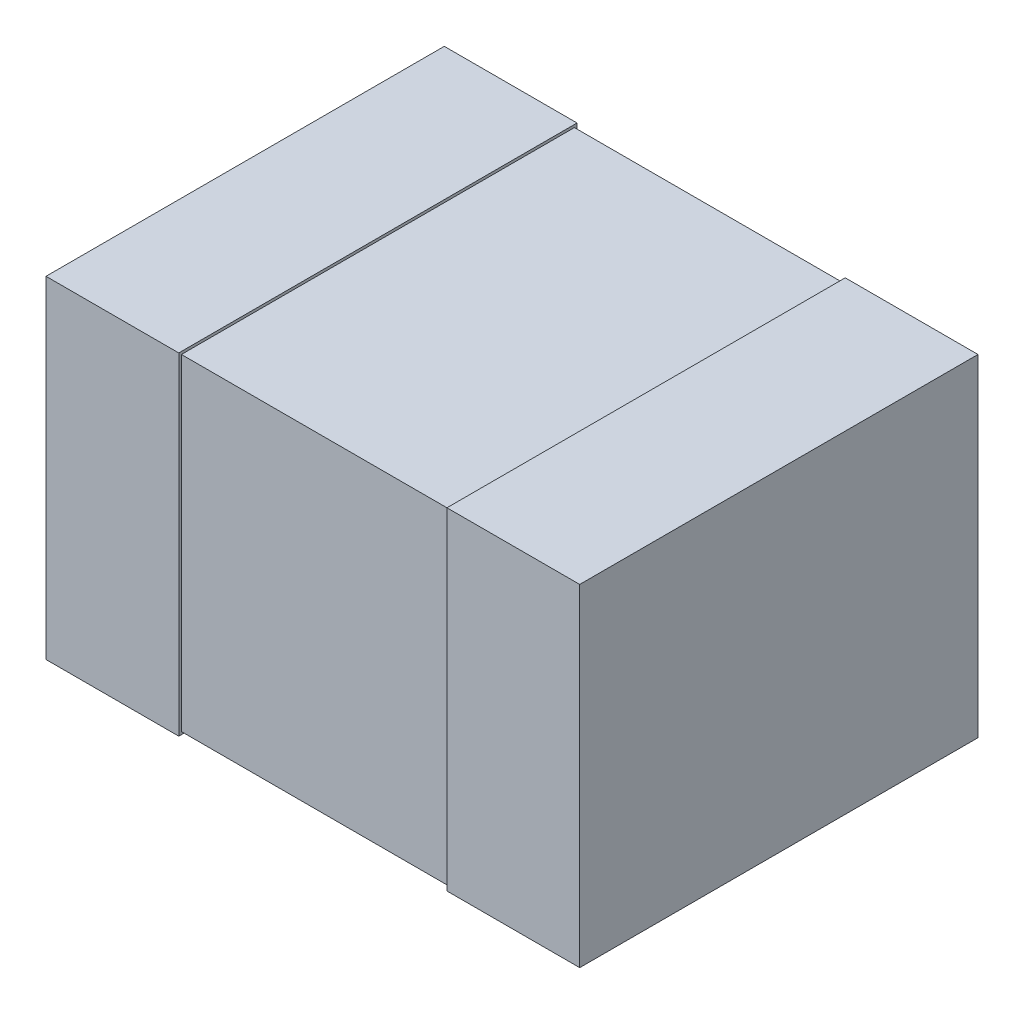
ISO-10303-21;
HEADER;
FILE_DESCRIPTION(('STEP AP214'),'2;1');
FILE_NAME('part.step','',(''),(''),'','','');
FILE_SCHEMA(('AUTOMOTIVE_DESIGN { 1 0 10303 214 1 1 1 1 }'));
ENDSEC;
DATA;
#1=APPLICATION_CONTEXT('core data for automotive mechanical design processes');
#2=APPLICATION_PROTOCOL_DEFINITION('international standard','automotive_design',2000,#1);
#3=PRODUCT_CONTEXT('',#1,'mechanical');
#4=PRODUCT('Part','Part','',(#3));
#5=PRODUCT_RELATED_PRODUCT_CATEGORY('part','',(#4));
#6=PRODUCT_DEFINITION_FORMATION('','',#4);
#7=PRODUCT_DEFINITION_CONTEXT('part definition',#1,'design');
#8=PRODUCT_DEFINITION('design','',#6,#7);
#9=PRODUCT_DEFINITION_SHAPE('','',#8);
#10=(LENGTH_UNIT() NAMED_UNIT(*) SI_UNIT(.MILLI.,.METRE.));
#11=(NAMED_UNIT(*) PLANE_ANGLE_UNIT() SI_UNIT($,.RADIAN.));
#12=(NAMED_UNIT(*) SI_UNIT($,.STERADIAN.) SOLID_ANGLE_UNIT());
#13=UNCERTAINTY_MEASURE_WITH_UNIT(LENGTH_MEASURE(1.E-05),#10,'distance_accuracy_value','');
#14=(GEOMETRIC_REPRESENTATION_CONTEXT(3) GLOBAL_UNCERTAINTY_ASSIGNED_CONTEXT((#13)) GLOBAL_UNIT_ASSIGNED_CONTEXT((#10,
#11,#12)) REPRESENTATION_CONTEXT('',''));
#15=CARTESIAN_POINT('',(0.,0.,0.));
#16=DIRECTION('',(0.,0.,1.));
#17=DIRECTION('',(1.,0.,0.));
#18=AXIS2_PLACEMENT_3D('',#15,#16,#17);
#19=CARTESIAN_POINT('',(1.005,-0.625,0.0762));
#20=DIRECTION('',(1.,0.,0.));
#21=DIRECTION('',(0.,1.,0.));
#22=AXIS2_PLACEMENT_3D('',#19,#20,#21);
#23=PLANE('',#22);
#24=DIRECTION('',(0.,1.,0.));
#25=VECTOR('',#24,1.);
#26=CARTESIAN_POINT('',(1.005,-0.625,0.0762));
#27=LINE('',#26,#25);
#28=CARTESIAN_POINT('',(1.005,-0.625,0.0762));
#29=VERTEX_POINT('',#28);
#30=CARTESIAN_POINT('',(1.005,0.625,0.0762));
#31=VERTEX_POINT('',#30);
#32=EDGE_CURVE('E207',#29,#31,#27,.T.);
#33=ORIENTED_EDGE('',*,*,#32,.T.);
#34=DIRECTION('',(0.,0.,1.));
#35=VECTOR('',#34,1.);
#36=CARTESIAN_POINT('',(1.005,0.625,0.0762));
#37=LINE('',#36,#35);
#38=CARTESIAN_POINT('',(1.005,0.625,1.5762));
#39=VERTEX_POINT('',#38);
#40=EDGE_CURVE('E145',#31,#39,#37,.T.);
#41=ORIENTED_EDGE('',*,*,#40,.T.);
#42=DIRECTION('',(0.,1.,0.));
#43=VECTOR('',#42,1.);
#44=CARTESIAN_POINT('',(1.005,-0.625,1.5762));
#45=LINE('',#44,#43);
#46=CARTESIAN_POINT('',(1.005,-0.625,1.5762));
#47=VERTEX_POINT('',#46);
#48=EDGE_CURVE('E141',#47,#39,#45,.T.);
#49=ORIENTED_EDGE('',*,*,#48,.F.);
#50=DIRECTION('',(0.,0.,1.));
#51=VECTOR('',#50,1.);
#52=CARTESIAN_POINT('',(1.005,-0.625,0.0762));
#53=LINE('',#52,#51);
#54=EDGE_CURVE('E11',#29,#47,#53,.T.);
#55=ORIENTED_EDGE('',*,*,#54,.F.);
#56=EDGE_LOOP('',(#33,#41,#49,#55));
#57=FACE_BOUND('',#56,.T.);
#58=ADVANCED_FACE('F17',(#57),#23,.T.);
#59=CARTESIAN_POINT('',(-1.005,0.625,0.0762));
#60=DIRECTION('',(-1.,0.,0.));
#61=DIRECTION('',(0.,0.,1.));
#62=AXIS2_PLACEMENT_3D('',#59,#60,#61);
#63=PLANE('',#62);
#64=DIRECTION('',(0.,-1.,0.));
#65=VECTOR('',#64,1.);
#66=CARTESIAN_POINT('',(-1.005,0.625,0.0762));
#67=LINE('',#66,#65);
#68=CARTESIAN_POINT('',(-1.005,0.625,0.0762));
#69=VERTEX_POINT('',#68);
#70=CARTESIAN_POINT('',(-1.005,-0.625,0.0762));
#71=VERTEX_POINT('',#70);
#72=EDGE_CURVE('E196',#69,#71,#67,.T.);
#73=ORIENTED_EDGE('',*,*,#72,.T.);
#74=DIRECTION('',(0.,0.,1.));
#75=VECTOR('',#74,1.);
#76=CARTESIAN_POINT('',(-1.005,-0.625,0.0762));
#77=LINE('',#76,#75);
#78=CARTESIAN_POINT('',(-1.005,-0.625,1.5762));
#79=VERTEX_POINT('',#78);
#80=EDGE_CURVE('E28',#71,#79,#77,.T.);
#81=ORIENTED_EDGE('',*,*,#80,.T.);
#82=DIRECTION('',(0.,-1.,0.));
#83=VECTOR('',#82,1.);
#84=CARTESIAN_POINT('',(-1.005,0.625,1.5762));
#85=LINE('',#84,#83);
#86=CARTESIAN_POINT('',(-1.005,0.625,1.5762));
#87=VERTEX_POINT('',#86);
#88=EDGE_CURVE('E215',#87,#79,#85,.T.);
#89=ORIENTED_EDGE('',*,*,#88,.F.);
#90=DIRECTION('',(0.,0.,1.));
#91=VECTOR('',#90,1.);
#92=CARTESIAN_POINT('',(-1.005,0.625,0.0762));
#93=LINE('',#92,#91);
#94=EDGE_CURVE('E157',#69,#87,#93,.T.);
#95=ORIENTED_EDGE('',*,*,#94,.F.);
#96=EDGE_LOOP('',(#73,#81,#89,#95));
#97=FACE_BOUND('',#96,.T.);
#98=ADVANCED_FACE('F309',(#97),#63,.T.);
#99=CARTESIAN_POINT('',(-1.005,-0.625,0.0762));
#100=DIRECTION('',(0.,-1.,0.));
#101=DIRECTION('',(0.,0.,-1.));
#102=AXIS2_PLACEMENT_3D('',#99,#100,#101);
#103=PLANE('',#102);
#104=DIRECTION('',(0.,0.,1.));
#105=VECTOR('',#104,1.);
#106=CARTESIAN_POINT('',(0.505,-0.625,0.0762));
#107=LINE('',#106,#105);
#108=CARTESIAN_POINT('',(0.505,-0.625,0.0762));
#109=VERTEX_POINT('',#108);
#110=CARTESIAN_POINT('',(0.505,-0.625,1.5762));
#111=VERTEX_POINT('',#110);
#112=EDGE_CURVE('E21',#109,#111,#107,.T.);
#113=ORIENTED_EDGE('',*,*,#112,.F.);
#114=DIRECTION('',(1.,0.,0.));
#115=VECTOR('',#114,1.);
#116=CARTESIAN_POINT('',(0.505,-0.625,0.0762));
#117=LINE('',#116,#115);
#118=EDGE_CURVE('E203',#109,#29,#117,.T.);
#119=ORIENTED_EDGE('',*,*,#118,.T.);
#120=ORIENTED_EDGE('',*,*,#54,.T.);
#121=DIRECTION('',(1.,0.,0.));
#122=VECTOR('',#121,1.);
#123=CARTESIAN_POINT('',(0.505,-0.625,1.5762));
#124=LINE('',#123,#122);
#125=EDGE_CURVE('E202',#111,#47,#124,.T.);
#126=ORIENTED_EDGE('',*,*,#125,.F.);
#127=EDGE_LOOP('',(#113,#119,#120,#126));
#128=FACE_BOUND('',#127,.T.);
#129=ADVANCED_FACE('F311',(#128),#103,.T.);
#130=CARTESIAN_POINT('',(-1.005,-0.625,0.0762));
#131=DIRECTION('',(0.,-1.,0.));
#132=DIRECTION('',(0.,0.,-1.));
#133=AXIS2_PLACEMENT_3D('',#130,#131,#132);
#134=PLANE('',#133);
#135=DIRECTION('',(0.,0.,1.));
#136=VECTOR('',#135,1.);
#137=CARTESIAN_POINT('',(-0.505,-0.625,0.0762));
#138=LINE('',#137,#136);
#139=CARTESIAN_POINT('',(-0.505,-0.625,0.0762));
#140=VERTEX_POINT('',#139);
#141=CARTESIAN_POINT('',(-0.505,-0.625,1.5762));
#142=VERTEX_POINT('',#141);
#143=EDGE_CURVE('E199',#140,#142,#138,.T.);
#144=ORIENTED_EDGE('',*,*,#143,.T.);
#145=DIRECTION('',(1.,0.,0.));
#146=VECTOR('',#145,1.);
#147=CARTESIAN_POINT('',(-1.005,-0.625,1.5762));
#148=LINE('',#147,#146);
#149=EDGE_CURVE('E219',#79,#142,#148,.T.);
#150=ORIENTED_EDGE('',*,*,#149,.F.);
#151=ORIENTED_EDGE('',*,*,#80,.F.);
#152=DIRECTION('',(1.,0.,0.));
#153=VECTOR('',#152,1.);
#154=CARTESIAN_POINT('',(-1.005,-0.625,0.0762));
#155=LINE('',#154,#153);
#156=EDGE_CURVE('E169',#71,#140,#155,.T.);
#157=ORIENTED_EDGE('',*,*,#156,.T.);
#158=EDGE_LOOP('',(#144,#150,#151,#157));
#159=FACE_BOUND('',#158,.T.);
#160=ADVANCED_FACE('F291',(#159),#134,.T.);
#161=CARTESIAN_POINT('',(0.,0.,1.5762));
#162=DIRECTION('',(0.,0.,1.));
#163=DIRECTION('',(1.,0.,0.));
#164=AXIS2_PLACEMENT_3D('',#161,#162,#163);
#165=PLANE('',#164);
#166=DIRECTION('',(0.,1.,0.));
#167=VECTOR('',#166,1.);
#168=CARTESIAN_POINT('',(0.505,-0.625,1.5762));
#169=LINE('',#168,#167);
#170=CARTESIAN_POINT('',(0.505,0.625,1.5762));
#171=VERTEX_POINT('',#170);
#172=EDGE_CURVE('E139',#111,#171,#169,.T.);
#173=ORIENTED_EDGE('',*,*,#172,.F.);
#174=ORIENTED_EDGE('',*,*,#125,.T.);
#175=ORIENTED_EDGE('',*,*,#48,.T.);
#176=DIRECTION('',(-1.,0.,0.));
#177=VECTOR('',#176,1.);
#178=CARTESIAN_POINT('',(1.005,0.625,1.5762));
#179=LINE('',#178,#177);
#180=EDGE_CURVE('E135',#39,#171,#179,.T.);
#181=ORIENTED_EDGE('',*,*,#180,.T.);
#182=EDGE_LOOP('',(#173,#174,#175,#181));
#183=FACE_BOUND('',#182,.T.);
#184=ADVANCED_FACE('F19',(#183),#165,.T.);
#185=CARTESIAN_POINT('',(0.,0.,1.5762));
#186=DIRECTION('',(0.,0.,1.));
#187=DIRECTION('',(1.,0.,0.));
#188=AXIS2_PLACEMENT_3D('',#185,#186,#187);
#189=PLANE('',#188);
#190=DIRECTION('',(0.,1.,0.));
#191=VECTOR('',#190,1.);
#192=CARTESIAN_POINT('',(-0.505,-0.625,1.5762));
#193=LINE('',#192,#191);
#194=CARTESIAN_POINT('',(-0.505,0.625,1.5762));
#195=VERTEX_POINT('',#194);
#196=EDGE_CURVE('E228',#142,#195,#193,.T.);
#197=ORIENTED_EDGE('',*,*,#196,.T.);
#198=DIRECTION('',(-1.,0.,0.));
#199=VECTOR('',#198,1.);
#200=CARTESIAN_POINT('',(-0.505,0.625,1.5762));
#201=LINE('',#200,#199);
#202=EDGE_CURVE('E146',#195,#87,#201,.T.);
#203=ORIENTED_EDGE('',*,*,#202,.T.);
#204=ORIENTED_EDGE('',*,*,#88,.T.);
#205=ORIENTED_EDGE('',*,*,#149,.T.);
#206=EDGE_LOOP('',(#197,#203,#204,#205));
#207=FACE_BOUND('',#206,.T.);
#208=ADVANCED_FACE('F307',(#207),#189,.T.);
#209=CARTESIAN_POINT('',(1.005,0.625,0.0762));
#210=DIRECTION('',(0.,1.,0.));
#211=DIRECTION('',(1.,0.,0.));
#212=AXIS2_PLACEMENT_3D('',#209,#210,#211);
#213=PLANE('',#212);
#214=DIRECTION('',(0.,0.,1.));
#215=VECTOR('',#214,1.);
#216=CARTESIAN_POINT('',(0.505,0.625,0.0762));
#217=LINE('',#216,#215);
#218=CARTESIAN_POINT('',(0.505,0.625,0.0762));
#219=VERTEX_POINT('',#218);
#220=EDGE_CURVE('E149',#219,#171,#217,.T.);
#221=ORIENTED_EDGE('',*,*,#220,.T.);
#222=ORIENTED_EDGE('',*,*,#180,.F.);
#223=ORIENTED_EDGE('',*,*,#40,.F.);
#224=DIRECTION('',(-1.,0.,0.));
#225=VECTOR('',#224,1.);
#226=CARTESIAN_POINT('',(1.005,0.625,0.0762));
#227=LINE('',#226,#225);
#228=EDGE_CURVE('E152',#31,#219,#227,.T.);
#229=ORIENTED_EDGE('',*,*,#228,.T.);
#230=EDGE_LOOP('',(#221,#222,#223,#229));
#231=FACE_BOUND('',#230,.T.);
#232=ADVANCED_FACE('F150',(#231),#213,.T.);
#233=CARTESIAN_POINT('',(1.005,0.625,0.0762));
#234=DIRECTION('',(0.,1.,0.));
#235=DIRECTION('',(1.,0.,0.));
#236=AXIS2_PLACEMENT_3D('',#233,#234,#235);
#237=PLANE('',#236);
#238=DIRECTION('',(0.,0.,1.));
#239=VECTOR('',#238,1.);
#240=CARTESIAN_POINT('',(-0.505,0.625,0.0762));
#241=LINE('',#240,#239);
#242=CARTESIAN_POINT('',(-0.505,0.625,0.0762));
#243=VERTEX_POINT('',#242);
#244=EDGE_CURVE('E206',#243,#195,#241,.T.);
#245=ORIENTED_EDGE('',*,*,#244,.F.);
#246=DIRECTION('',(-1.,0.,0.));
#247=VECTOR('',#246,1.);
#248=CARTESIAN_POINT('',(-0.505,0.625,0.0762));
#249=LINE('',#248,#247);
#250=EDGE_CURVE('E191',#243,#69,#249,.T.);
#251=ORIENTED_EDGE('',*,*,#250,.T.);
#252=ORIENTED_EDGE('',*,*,#94,.T.);
#253=ORIENTED_EDGE('',*,*,#202,.F.);
#254=EDGE_LOOP('',(#245,#251,#252,#253));
#255=FACE_BOUND('',#254,.T.);
#256=ADVANCED_FACE('F301',(#255),#237,.T.);
#257=CARTESIAN_POINT('',(0.505,-0.625,0.0862));
#258=DIRECTION('',(1.,0.,0.));
#259=DIRECTION('',(0.,1.,0.));
#260=AXIS2_PLACEMENT_3D('',#257,#258,#259);
#261=PLANE('',#260);
#262=DIRECTION('',(0.,1.,0.));
#263=VECTOR('',#262,1.);
#264=CARTESIAN_POINT('',(0.505,-0.615,0.0862));
#265=LINE('',#264,#263);
#266=CARTESIAN_POINT('',(0.505,-0.615,0.0862));
#267=VERTEX_POINT('',#266);
#268=CARTESIAN_POINT('',(0.505,0.615,0.0862));
#269=VERTEX_POINT('',#268);
#270=EDGE_CURVE('E166',#267,#269,#265,.T.);
#271=ORIENTED_EDGE('',*,*,#270,.T.);
#272=DIRECTION('',(0.,0.,1.));
#273=VECTOR('',#272,1.);
#274=CARTESIAN_POINT('',(0.505,0.615,0.0862));
#275=LINE('',#274,#273);
#276=CARTESIAN_POINT('',(0.505,0.615,1.5662));
#277=VERTEX_POINT('',#276);
#278=EDGE_CURVE('E190',#269,#277,#275,.T.);
#279=ORIENTED_EDGE('',*,*,#278,.T.);
#280=DIRECTION('',(0.,-1.,0.));
#281=VECTOR('',#280,1.);
#282=CARTESIAN_POINT('',(0.505,0.615,1.5662));
#283=LINE('',#282,#281);
#284=CARTESIAN_POINT('',(0.505,-0.615,1.5662));
#285=VERTEX_POINT('',#284);
#286=EDGE_CURVE('E182',#277,#285,#283,.T.);
#287=ORIENTED_EDGE('',*,*,#286,.T.);
#288=DIRECTION('',(0.,0.,-1.));
#289=VECTOR('',#288,1.);
#290=CARTESIAN_POINT('',(0.505,-0.615,1.5662));
#291=LINE('',#290,#289);
#292=EDGE_CURVE('E211',#285,#267,#291,.T.);
#293=ORIENTED_EDGE('',*,*,#292,.T.);
#294=EDGE_LOOP('',(#271,#279,#287,#293));
#295=FACE_BOUND('',#294,.T.);
#296=DIRECTION('',(0.,1.,0.));
#297=VECTOR('',#296,1.);
#298=CARTESIAN_POINT('',(0.505,-0.625,0.0762));
#299=LINE('',#298,#297);
#300=EDGE_CURVE('E195',#109,#219,#299,.T.);
#301=ORIENTED_EDGE('',*,*,#300,.F.);
#302=ORIENTED_EDGE('',*,*,#112,.T.);
#303=ORIENTED_EDGE('',*,*,#172,.T.);
#304=ORIENTED_EDGE('',*,*,#220,.F.);
#305=EDGE_LOOP('',(#301,#302,#303,#304));
#306=FACE_BOUND('',#305,.T.);
#307=ADVANCED_FACE('F159',(#295,#306),#261,.F.);
#308=CARTESIAN_POINT('',(-0.505,-0.625,0.0862));
#309=DIRECTION('',(0.,0.,1.));
#310=DIRECTION('',(1.,0.,0.));
#311=AXIS2_PLACEMENT_3D('',#308,#309,#310);
#312=PLANE('',#311);
#313=DIRECTION('',(1.,0.,0.));
#314=VECTOR('',#313,1.);
#315=CARTESIAN_POINT('',(-0.505,-0.615,0.0862));
#316=LINE('',#315,#314);
#317=CARTESIAN_POINT('',(-0.505,-0.615,0.0862));
#318=VERTEX_POINT('',#317);
#319=EDGE_CURVE('E109',#318,#267,#316,.T.);
#320=ORIENTED_EDGE('',*,*,#319,.F.);
#321=DIRECTION('',(0.,1.,0.));
#322=VECTOR('',#321,1.);
#323=CARTESIAN_POINT('',(-0.505,-0.615,0.0862));
#324=LINE('',#323,#322);
#325=CARTESIAN_POINT('',(-0.505,0.615,0.0862));
#326=VERTEX_POINT('',#325);
#327=EDGE_CURVE('E174',#318,#326,#324,.T.);
#328=ORIENTED_EDGE('',*,*,#327,.T.);
#329=DIRECTION('',(1.,0.,0.));
#330=VECTOR('',#329,1.);
#331=CARTESIAN_POINT('',(-0.505,0.615,0.0862));
#332=LINE('',#331,#330);
#333=EDGE_CURVE('E185',#326,#269,#332,.T.);
#334=ORIENTED_EDGE('',*,*,#333,.T.);
#335=ORIENTED_EDGE('',*,*,#270,.F.);
#336=EDGE_LOOP('',(#320,#328,#334,#335));
#337=FACE_BOUND('',#336,.T.);
#338=ADVANCED_FACE('F330',(#337),#312,.F.);
#339=CARTESIAN_POINT('',(-0.505,0.615,0.0762));
#340=DIRECTION('',(0.,-1.,0.));
#341=DIRECTION('',(0.,0.,-1.));
#342=AXIS2_PLACEMENT_3D('',#339,#340,#341);
#343=PLANE('',#342);
#344=ORIENTED_EDGE('',*,*,#333,.F.);
#345=DIRECTION('',(0.,0.,1.));
#346=VECTOR('',#345,1.);
#347=CARTESIAN_POINT('',(-0.505,0.615,0.0862));
#348=LINE('',#347,#346);
#349=CARTESIAN_POINT('',(-0.505,0.615,1.5662));
#350=VERTEX_POINT('',#349);
#351=EDGE_CURVE('E176',#326,#350,#348,.T.);
#352=ORIENTED_EDGE('',*,*,#351,.T.);
#353=DIRECTION('',(1.,0.,0.));
#354=VECTOR('',#353,1.);
#355=CARTESIAN_POINT('',(-0.505,0.615,1.5662));
#356=LINE('',#355,#354);
#357=EDGE_CURVE('E186',#350,#277,#356,.T.);
#358=ORIENTED_EDGE('',*,*,#357,.T.);
#359=ORIENTED_EDGE('',*,*,#278,.F.);
#360=EDGE_LOOP('',(#344,#352,#358,#359));
#361=FACE_BOUND('',#360,.T.);
#362=ADVANCED_FACE('F333',(#361),#343,.F.);
#363=CARTESIAN_POINT('',(-0.505,0.625,1.5662));
#364=DIRECTION('',(0.,0.,-1.));
#365=DIRECTION('',(0.,-1.,0.));
#366=AXIS2_PLACEMENT_3D('',#363,#364,#365);
#367=PLANE('',#366);
#368=ORIENTED_EDGE('',*,*,#357,.F.);
#369=DIRECTION('',(0.,-1.,0.));
#370=VECTOR('',#369,1.);
#371=CARTESIAN_POINT('',(-0.505,0.615,1.5662));
#372=LINE('',#371,#370);
#373=CARTESIAN_POINT('',(-0.505,-0.615,1.5662));
#374=VERTEX_POINT('',#373);
#375=EDGE_CURVE('E178',#350,#374,#372,.T.);
#376=ORIENTED_EDGE('',*,*,#375,.T.);
#377=DIRECTION('',(1.,0.,0.));
#378=VECTOR('',#377,1.);
#379=CARTESIAN_POINT('',(-0.505,-0.615,1.5662));
#380=LINE('',#379,#378);
#381=EDGE_CURVE('E122',#374,#285,#380,.T.);
#382=ORIENTED_EDGE('',*,*,#381,.T.);
#383=ORIENTED_EDGE('',*,*,#286,.F.);
#384=EDGE_LOOP('',(#368,#376,#382,#383));
#385=FACE_BOUND('',#384,.T.);
#386=ADVANCED_FACE('F254',(#385),#367,.F.);
#387=CARTESIAN_POINT('',(-0.505,-0.615,1.5762));
#388=DIRECTION('',(0.,1.,0.));
#389=DIRECTION('',(1.,0.,0.));
#390=AXIS2_PLACEMENT_3D('',#387,#388,#389);
#391=PLANE('',#390);
#392=ORIENTED_EDGE('',*,*,#381,.F.);
#393=DIRECTION('',(0.,0.,-1.));
#394=VECTOR('',#393,1.);
#395=CARTESIAN_POINT('',(-0.505,-0.615,1.5662));
#396=LINE('',#395,#394);
#397=EDGE_CURVE('E181',#374,#318,#396,.T.);
#398=ORIENTED_EDGE('',*,*,#397,.T.);
#399=ORIENTED_EDGE('',*,*,#319,.T.);
#400=ORIENTED_EDGE('',*,*,#292,.F.);
#401=EDGE_LOOP('',(#392,#398,#399,#400));
#402=FACE_BOUND('',#401,.T.);
#403=ADVANCED_FACE('F261',(#402),#391,.F.);
#404=CARTESIAN_POINT('',(-0.505,-0.625,0.0762));
#405=DIRECTION('',(-1.,0.,0.));
#406=DIRECTION('',(0.,0.,1.));
#407=AXIS2_PLACEMENT_3D('',#404,#405,#406);
#408=PLANE('',#407);
#409=ORIENTED_EDGE('',*,*,#397,.F.);
#410=ORIENTED_EDGE('',*,*,#375,.F.);
#411=ORIENTED_EDGE('',*,*,#351,.F.);
#412=ORIENTED_EDGE('',*,*,#327,.F.);
#413=EDGE_LOOP('',(#409,#410,#411,#412));
#414=FACE_BOUND('',#413,.T.);
#415=DIRECTION('',(0.,1.,0.));
#416=VECTOR('',#415,1.);
#417=CARTESIAN_POINT('',(-0.505,-0.625,0.0762));
#418=LINE('',#417,#416);
#419=EDGE_CURVE('E279',#140,#243,#418,.T.);
#420=ORIENTED_EDGE('',*,*,#419,.T.);
#421=ORIENTED_EDGE('',*,*,#244,.T.);
#422=ORIENTED_EDGE('',*,*,#196,.F.);
#423=ORIENTED_EDGE('',*,*,#143,.F.);
#424=EDGE_LOOP('',(#420,#421,#422,#423));
#425=FACE_BOUND('',#424,.T.);
#426=ADVANCED_FACE('F259',(#414,#425),#408,.F.);
#427=CARTESIAN_POINT('',(0.,0.,0.0762));
#428=DIRECTION('',(0.,0.,1.));
#429=DIRECTION('',(1.,0.,0.));
#430=AXIS2_PLACEMENT_3D('',#427,#428,#429);
#431=PLANE('',#430);
#432=ORIENTED_EDGE('',*,*,#300,.T.);
#433=ORIENTED_EDGE('',*,*,#228,.F.);
#434=ORIENTED_EDGE('',*,*,#32,.F.);
#435=ORIENTED_EDGE('',*,*,#118,.F.);
#436=EDGE_LOOP('',(#432,#433,#434,#435));
#437=FACE_BOUND('',#436,.T.);
#438=ADVANCED_FACE('F327',(#437),#431,.F.);
#439=CARTESIAN_POINT('',(0.,0.,0.0762));
#440=DIRECTION('',(0.,0.,1.));
#441=DIRECTION('',(1.,0.,0.));
#442=AXIS2_PLACEMENT_3D('',#439,#440,#441);
#443=PLANE('',#442);
#444=ORIENTED_EDGE('',*,*,#419,.F.);
#445=ORIENTED_EDGE('',*,*,#156,.F.);
#446=ORIENTED_EDGE('',*,*,#72,.F.);
#447=ORIENTED_EDGE('',*,*,#250,.F.);
#448=EDGE_LOOP('',(#444,#445,#446,#447));
#449=FACE_BOUND('',#448,.T.);
#450=ADVANCED_FACE('F297',(#449),#443,.F.);
#451=CLOSED_SHELL('',(#58,#98,#129,#160,#184,#208,#232,#256,#307,#338,#362,#386,#403,#426,#438,#450));
#452=MANIFOLD_SOLID_BREP('B1',#451);
#453=ADVANCED_BREP_SHAPE_REPRESENTATION('',(#18,#452),#14);
#454=SHAPE_DEFINITION_REPRESENTATION(#9,#453);
ENDSEC;
END-ISO-10303-21;
